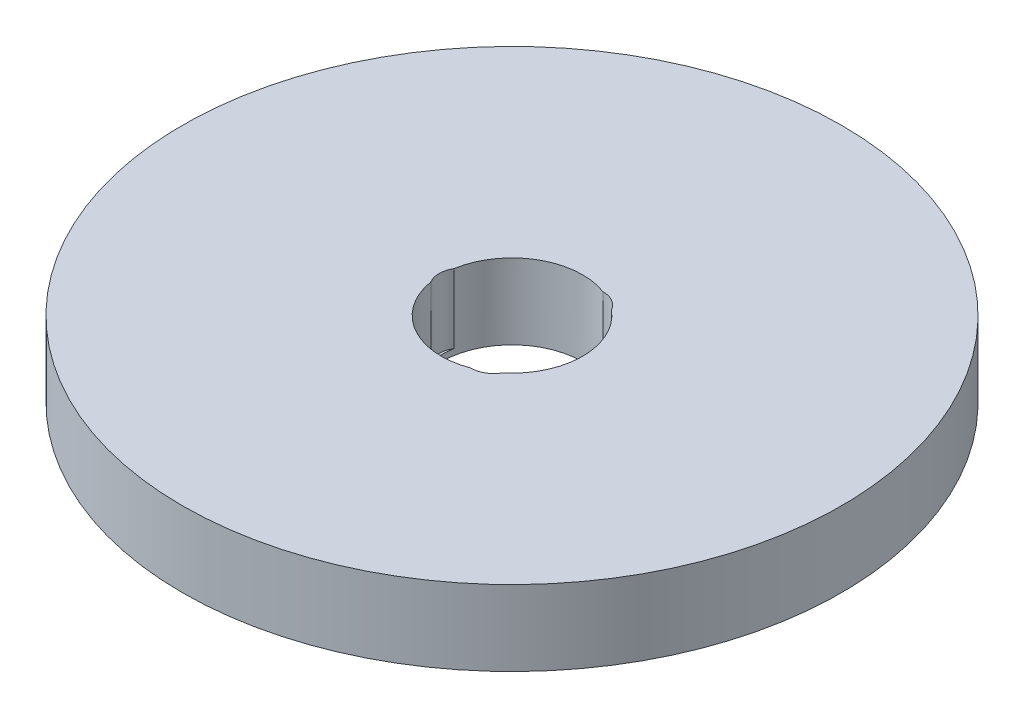
ISO-10303-21;
HEADER;
FILE_DESCRIPTION(('STEP AP214'),'2;1');
FILE_NAME('part.step','',(''),(''),'','','');
FILE_SCHEMA(('AUTOMOTIVE_DESIGN { 1 0 10303 214 1 1 1 1 }'));
ENDSEC;
DATA;
#1=APPLICATION_CONTEXT('core data for automotive mechanical design processes');
#2=APPLICATION_PROTOCOL_DEFINITION('international standard','automotive_design',2000,#1);
#3=PRODUCT_CONTEXT('',#1,'mechanical');
#4=PRODUCT('Part','Part','',(#3));
#5=PRODUCT_RELATED_PRODUCT_CATEGORY('part','',(#4));
#6=PRODUCT_DEFINITION_FORMATION('','',#4);
#7=PRODUCT_DEFINITION_CONTEXT('part definition',#1,'design');
#8=PRODUCT_DEFINITION('design','',#6,#7);
#9=PRODUCT_DEFINITION_SHAPE('','',#8);
#10=(LENGTH_UNIT() NAMED_UNIT(*) SI_UNIT(.MILLI.,.METRE.));
#11=(NAMED_UNIT(*) PLANE_ANGLE_UNIT() SI_UNIT($,.RADIAN.));
#12=(NAMED_UNIT(*) SI_UNIT($,.STERADIAN.) SOLID_ANGLE_UNIT());
#13=UNCERTAINTY_MEASURE_WITH_UNIT(LENGTH_MEASURE(1.E-05),#10,'distance_accuracy_value','');
#14=(GEOMETRIC_REPRESENTATION_CONTEXT(3) GLOBAL_UNCERTAINTY_ASSIGNED_CONTEXT((#13)) GLOBAL_UNIT_ASSIGNED_CONTEXT((#10,
#11,#12)) REPRESENTATION_CONTEXT('',''));
#15=CARTESIAN_POINT('',(0.,0.,0.));
#16=DIRECTION('',(0.,0.,1.));
#17=DIRECTION('',(1.,0.,0.));
#18=AXIS2_PLACEMENT_3D('',#15,#16,#17);
#19=CARTESIAN_POINT('',(0.,16.,0.));
#20=DIRECTION('',(0.,-1.,0.));
#21=DIRECTION('',(0.,0.,-1.));
#22=AXIS2_PLACEMENT_3D('',#19,#20,#21);
#23=CYLINDRICAL_SURFACE('',#22,70.);
#24=CARTESIAN_POINT('',(0.,16.,0.));
#25=DIRECTION('',(0.,1.,0.));
#26=DIRECTION('',(0.,0.,1.));
#27=AXIS2_PLACEMENT_3D('',#24,#25,#26);
#28=CIRCLE('',#27,70.);
#29=CARTESIAN_POINT('',(0.,16.,70.));
#30=VERTEX_POINT('',#29);
#31=EDGE_CURVE('E130',#30,#30,#28,.T.);
#32=ORIENTED_EDGE('',*,*,#31,.F.);
#33=EDGE_LOOP('',(#32));
#34=FACE_BOUND('',#33,.T.);
#35=CARTESIAN_POINT('',(0.,0.,0.));
#36=DIRECTION('',(0.,1.,0.));
#37=DIRECTION('',(0.,0.,1.));
#38=AXIS2_PLACEMENT_3D('',#35,#36,#37);
#39=CIRCLE('',#38,70.);
#40=CARTESIAN_POINT('',(0.,0.,70.));
#41=VERTEX_POINT('',#40);
#42=EDGE_CURVE('E117',#41,#41,#39,.T.);
#43=ORIENTED_EDGE('',*,*,#42,.T.);
#44=EDGE_LOOP('',(#43));
#45=FACE_BOUND('',#44,.T.);
#46=ADVANCED_FACE('F39',(#34,#45),#23,.T.);
#47=CARTESIAN_POINT('',(0.,16.,0.));
#48=DIRECTION('',(0.,1.,0.));
#49=DIRECTION('',(0.,0.,1.));
#50=AXIS2_PLACEMENT_3D('',#47,#48,#49);
#51=PLANE('',#50);
#52=CARTESIAN_POINT('',(5.33914929412219,16.,9.24767784661505));
#53=DIRECTION('',(0.,1.,0.));
#54=DIRECTION('',(0.866025403784436,0.,-0.500000000000004));
#55=AXIS2_PLACEMENT_3D('',#52,#53,#54);
#56=CIRCLE('',#55,4.7905133888294);
#57=CARTESIAN_POINT('',(5.28560208480681,16.,14.0378919571667));
#58=VERTEX_POINT('',#57);
#59=CARTESIAN_POINT('',(9.51437000808433,16.,11.596411658322));
#60=VERTEX_POINT('',#59);
#61=EDGE_CURVE('E148',#58,#60,#56,.T.);
#62=ORIENTED_EDGE('',*,*,#61,.F.);
#63=CARTESIAN_POINT('',(0.,16.,0.));
#64=DIRECTION('',(0.,1.,0.));
#65=DIRECTION('',(0.,0.,1.));
#66=AXIS2_PLACEMENT_3D('',#63,#64,#65);
#67=CIRCLE('',#66,15.);
#68=CARTESIAN_POINT('',(-14.799972092891,16.,2.44148029884474));
#69=VERTEX_POINT('',#68);
#70=EDGE_CURVE('E113',#69,#58,#67,.T.);
#71=ORIENTED_EDGE('',*,*,#70,.F.);
#72=CARTESIAN_POINT('',(-10.6782985882443,16.,0.));
#73=DIRECTION('',(0.,1.,0.));
#74=DIRECTION('',(0.,0.,1.));
#75=AXIS2_PLACEMENT_3D('',#72,#73,#74);
#76=CIRCLE('',#75,4.7905133888294);
#77=CARTESIAN_POINT('',(-14.799972092891,16.,-2.44148029884474));
#78=VERTEX_POINT('',#77);
#79=EDGE_CURVE('E125',#78,#69,#76,.T.);
#80=ORIENTED_EDGE('',*,*,#79,.F.);
#81=CARTESIAN_POINT('',(5.28560208480661,16.,-14.0378919571668));
#82=VERTEX_POINT('',#81);
#83=EDGE_CURVE('E107',#82,#78,#67,.T.);
#84=ORIENTED_EDGE('',*,*,#83,.F.);
#85=CARTESIAN_POINT('',(5.33914929412206,16.,-9.24767784661512));
#86=DIRECTION('',(0.,1.,0.));
#87=DIRECTION('',(-0.866025403784443,0.,-0.499999999999992));
#88=AXIS2_PLACEMENT_3D('',#85,#86,#87);
#89=CIRCLE('',#88,4.7905133888294);
#90=CARTESIAN_POINT('',(9.51437000808417,16.,-11.5964116583221));
#91=VERTEX_POINT('',#90);
#92=EDGE_CURVE('E95',#91,#82,#89,.T.);
#93=ORIENTED_EDGE('',*,*,#92,.F.);
#94=EDGE_CURVE('E106',#60,#91,#67,.T.);
#95=ORIENTED_EDGE('',*,*,#94,.F.);
#96=EDGE_LOOP('',(#62,#71,#80,#84,#93,#95));
#97=FACE_BOUND('',#96,.T.);
#98=ORIENTED_EDGE('',*,*,#31,.T.);
#99=EDGE_LOOP('',(#98));
#100=FACE_BOUND('',#99,.T.);
#101=ADVANCED_FACE('F102',(#97,#100),#51,.T.);
#102=CARTESIAN_POINT('',(0.,0.,0.));
#103=DIRECTION('',(0.,1.,0.));
#104=DIRECTION('',(0.,0.,1.));
#105=AXIS2_PLACEMENT_3D('',#102,#103,#104);
#106=PLANE('',#105);
#107=CARTESIAN_POINT('',(0.,0.,0.));
#108=DIRECTION('',(0.,1.,0.));
#109=DIRECTION('',(0.,0.,1.));
#110=AXIS2_PLACEMENT_3D('',#107,#108,#109);
#111=CIRCLE('',#110,15.);
#112=CARTESIAN_POINT('',(0.,0.,15.));
#113=VERTEX_POINT('',#112);
#114=EDGE_CURVE('E118',#113,#113,#111,.T.);
#115=ORIENTED_EDGE('',*,*,#114,.T.);
#116=EDGE_LOOP('',(#115));
#117=FACE_BOUND('',#116,.T.);
#118=ORIENTED_EDGE('',*,*,#42,.F.);
#119=EDGE_LOOP('',(#118));
#120=FACE_BOUND('',#119,.T.);
#121=ADVANCED_FACE('F161',(#117,#120),#106,.F.);
#122=CARTESIAN_POINT('',(0.,16.,0.));
#123=DIRECTION('',(0.,-1.,0.));
#124=DIRECTION('',(0.,0.,-1.));
#125=AXIS2_PLACEMENT_3D('',#122,#123,#124);
#126=CYLINDRICAL_SURFACE('',#125,15.);
#127=DIRECTION('',(0.,1.,0.));
#128=VECTOR('',#127,1.);
#129=CARTESIAN_POINT('',(5.28560208480681,8.64533122078051,14.0378919571667));
#130=LINE('',#129,#128);
#131=CARTESIAN_POINT('',(5.28560208480681,1.29066244156101,14.0378919571667));
#132=VERTEX_POINT('',#131);
#133=EDGE_CURVE('E11',#132,#58,#130,.T.);
#134=ORIENTED_EDGE('',*,*,#133,.F.);
#135=CARTESIAN_POINT('',(0.,1.29066244156101,0.));
#136=DIRECTION('',(0.,1.,0.));
#137=DIRECTION('',(0.,0.,1.));
#138=AXIS2_PLACEMENT_3D('',#135,#136,#137);
#139=CIRCLE('',#138,15.);
#140=CARTESIAN_POINT('',(9.51437000808433,1.29066244156101,11.596411658322));
#141=VERTEX_POINT('',#140);
#142=EDGE_CURVE('E100',#132,#141,#139,.T.);
#143=ORIENTED_EDGE('',*,*,#142,.T.);
#144=DIRECTION('',(0.,1.,0.));
#145=VECTOR('',#144,1.);
#146=CARTESIAN_POINT('',(9.51437000808433,8.64533122078051,11.596411658322));
#147=LINE('',#146,#145);
#148=EDGE_CURVE('E46',#60,#141,#147,.F.);
#149=ORIENTED_EDGE('',*,*,#148,.F.);
#150=ORIENTED_EDGE('',*,*,#94,.T.);
#151=DIRECTION('',(0.,1.,0.));
#152=VECTOR('',#151,1.);
#153=CARTESIAN_POINT('',(9.51437000808417,8.64533122078051,-11.5964116583221));
#154=LINE('',#153,#152);
#155=CARTESIAN_POINT('',(9.51437000808417,1.29066244156101,-11.5964116583221));
#156=VERTEX_POINT('',#155);
#157=EDGE_CURVE('E90',#156,#91,#154,.T.);
#158=ORIENTED_EDGE('',*,*,#157,.F.);
#159=CARTESIAN_POINT('',(0.,1.29066244156101,0.));
#160=DIRECTION('',(0.,1.,0.));
#161=DIRECTION('',(0.,0.,1.));
#162=AXIS2_PLACEMENT_3D('',#159,#160,#161);
#163=CIRCLE('',#162,15.);
#164=CARTESIAN_POINT('',(5.28560208480661,1.29066244156101,-14.0378919571668));
#165=VERTEX_POINT('',#164);
#166=EDGE_CURVE('E143',#156,#165,#163,.T.);
#167=ORIENTED_EDGE('',*,*,#166,.T.);
#168=DIRECTION('',(0.,1.,0.));
#169=VECTOR('',#168,1.);
#170=CARTESIAN_POINT('',(5.28560208480661,8.64533122078051,-14.0378919571668));
#171=LINE('',#170,#169);
#172=EDGE_CURVE('E98',#82,#165,#171,.F.);
#173=ORIENTED_EDGE('',*,*,#172,.F.);
#174=ORIENTED_EDGE('',*,*,#83,.T.);
#175=DIRECTION('',(0.,1.,0.));
#176=VECTOR('',#175,1.);
#177=CARTESIAN_POINT('',(-14.799972092891,8.64533122078051,-2.44148029884474));
#178=LINE('',#177,#176);
#179=CARTESIAN_POINT('',(-14.799972092891,1.29066244156101,-2.44148029884474));
#180=VERTEX_POINT('',#179);
#181=EDGE_CURVE('E137',#180,#78,#178,.T.);
#182=ORIENTED_EDGE('',*,*,#181,.F.);
#183=CARTESIAN_POINT('',(0.,1.29066244156101,0.));
#184=DIRECTION('',(0.,1.,0.));
#185=DIRECTION('',(0.,0.,1.));
#186=AXIS2_PLACEMENT_3D('',#183,#184,#185);
#187=CIRCLE('',#186,15.);
#188=CARTESIAN_POINT('',(-14.799972092891,1.29066244156101,2.44148029884474));
#189=VERTEX_POINT('',#188);
#190=EDGE_CURVE('E128',#180,#189,#187,.T.);
#191=ORIENTED_EDGE('',*,*,#190,.T.);
#192=DIRECTION('',(0.,1.,0.));
#193=VECTOR('',#192,1.);
#194=CARTESIAN_POINT('',(-14.799972092891,8.64533122078051,2.44148029884474));
#195=LINE('',#194,#193);
#196=EDGE_CURVE('E134',#69,#189,#195,.F.);
#197=ORIENTED_EDGE('',*,*,#196,.F.);
#198=ORIENTED_EDGE('',*,*,#70,.T.);
#199=EDGE_LOOP('',(#134,#143,#149,#150,#158,#167,#173,#174,#182,#191,#197,#198));
#200=FACE_BOUND('',#199,.T.);
#201=ORIENTED_EDGE('',*,*,#114,.F.);
#202=EDGE_LOOP('',(#201));
#203=FACE_BOUND('',#202,.T.);
#204=ADVANCED_FACE('F115',(#200,#203),#126,.F.);
#205=CARTESIAN_POINT('',(-10.6782985882443,1.29066244156101,0.));
#206=DIRECTION('',(0.,1.,0.));
#207=DIRECTION('',(0.,0.,1.));
#208=AXIS2_PLACEMENT_3D('',#205,#206,#207);
#209=CYLINDRICAL_SURFACE('',#208,4.7905133888294);
#210=ORIENTED_EDGE('',*,*,#181,.T.);
#211=ORIENTED_EDGE('',*,*,#79,.T.);
#212=ORIENTED_EDGE('',*,*,#196,.T.);
#213=CARTESIAN_POINT('',(-10.6782985882443,1.29066244156101,0.));
#214=DIRECTION('',(0.,1.,0.));
#215=DIRECTION('',(0.,0.,1.));
#216=AXIS2_PLACEMENT_3D('',#213,#214,#215);
#217=CIRCLE('',#216,4.7905133888294);
#218=EDGE_CURVE('E127',#180,#189,#217,.T.);
#219=ORIENTED_EDGE('',*,*,#218,.F.);
#220=EDGE_LOOP('',(#210,#211,#212,#219));
#221=FACE_BOUND('',#220,.T.);
#222=ADVANCED_FACE('F175',(#221),#209,.F.);
#223=CARTESIAN_POINT('',(-10.6782985882443,1.29066244156101,0.));
#224=DIRECTION('',(0.,1.,0.));
#225=DIRECTION('',(0.,0.,1.));
#226=AXIS2_PLACEMENT_3D('',#223,#224,#225);
#227=PLANE('',#226);
#228=ORIENTED_EDGE('',*,*,#218,.T.);
#229=ORIENTED_EDGE('',*,*,#190,.F.);
#230=EDGE_LOOP('',(#228,#229));
#231=FACE_BOUND('',#230,.T.);
#232=ADVANCED_FACE('F176',(#231),#227,.T.);
#233=CARTESIAN_POINT('',(5.33914929412206,1.29066244156101,-9.24767784661512));
#234=DIRECTION('',(0.,1.,0.));
#235=DIRECTION('',(0.,0.,1.));
#236=AXIS2_PLACEMENT_3D('',#233,#234,#235);
#237=CYLINDRICAL_SURFACE('',#236,4.7905133888294);
#238=ORIENTED_EDGE('',*,*,#157,.T.);
#239=ORIENTED_EDGE('',*,*,#92,.T.);
#240=ORIENTED_EDGE('',*,*,#172,.T.);
#241=CARTESIAN_POINT('',(5.33914929412206,1.29066244156101,-9.24767784661512));
#242=DIRECTION('',(0.,1.,0.));
#243=DIRECTION('',(-0.866025403784443,0.,-0.499999999999992));
#244=AXIS2_PLACEMENT_3D('',#241,#242,#243);
#245=CIRCLE('',#244,4.7905133888294);
#246=EDGE_CURVE('E56',#156,#165,#245,.T.);
#247=ORIENTED_EDGE('',*,*,#246,.F.);
#248=EDGE_LOOP('',(#238,#239,#240,#247));
#249=FACE_BOUND('',#248,.T.);
#250=ADVANCED_FACE('F93',(#249),#237,.F.);
#251=CARTESIAN_POINT('',(5.33914929412206,1.29066244156101,-9.24767784661512));
#252=DIRECTION('',(0.,1.,0.));
#253=DIRECTION('',(-0.866025403784443,0.,-0.499999999999992));
#254=AXIS2_PLACEMENT_3D('',#251,#252,#253);
#255=PLANE('',#254);
#256=ORIENTED_EDGE('',*,*,#246,.T.);
#257=ORIENTED_EDGE('',*,*,#166,.F.);
#258=EDGE_LOOP('',(#256,#257));
#259=FACE_BOUND('',#258,.T.);
#260=ADVANCED_FACE('F153',(#259),#255,.T.);
#261=CARTESIAN_POINT('',(5.33914929412219,1.29066244156101,9.24767784661505));
#262=DIRECTION('',(0.,1.,0.));
#263=DIRECTION('',(0.,0.,1.));
#264=AXIS2_PLACEMENT_3D('',#261,#262,#263);
#265=CYLINDRICAL_SURFACE('',#264,4.7905133888294);
#266=ORIENTED_EDGE('',*,*,#133,.T.);
#267=ORIENTED_EDGE('',*,*,#61,.T.);
#268=ORIENTED_EDGE('',*,*,#148,.T.);
#269=CARTESIAN_POINT('',(5.33914929412219,1.29066244156101,9.24767784661505));
#270=DIRECTION('',(0.,1.,0.));
#271=DIRECTION('',(0.866025403784436,0.,-0.500000000000004));
#272=AXIS2_PLACEMENT_3D('',#269,#270,#271);
#273=CIRCLE('',#272,4.7905133888294);
#274=EDGE_CURVE('E55',#132,#141,#273,.T.);
#275=ORIENTED_EDGE('',*,*,#274,.F.);
#276=EDGE_LOOP('',(#266,#267,#268,#275));
#277=FACE_BOUND('',#276,.T.);
#278=ADVANCED_FACE('F144',(#277),#265,.F.);
#279=CARTESIAN_POINT('',(5.33914929412219,1.29066244156101,9.24767784661505));
#280=DIRECTION('',(0.,1.,0.));
#281=DIRECTION('',(0.866025403784436,0.,-0.500000000000004));
#282=AXIS2_PLACEMENT_3D('',#279,#280,#281);
#283=PLANE('',#282);
#284=ORIENTED_EDGE('',*,*,#274,.T.);
#285=ORIENTED_EDGE('',*,*,#142,.F.);
#286=EDGE_LOOP('',(#284,#285));
#287=FACE_BOUND('',#286,.T.);
#288=ADVANCED_FACE('F150',(#287),#283,.T.);
#289=CLOSED_SHELL('',(#46,#101,#121,#204,#222,#232,#250,#260,#278,#288));
#290=MANIFOLD_SOLID_BREP('B2',#289);
#291=ADVANCED_BREP_SHAPE_REPRESENTATION('',(#18,#290),#14);
#292=SHAPE_DEFINITION_REPRESENTATION(#9,#291);
ENDSEC;
END-ISO-10303-21;
